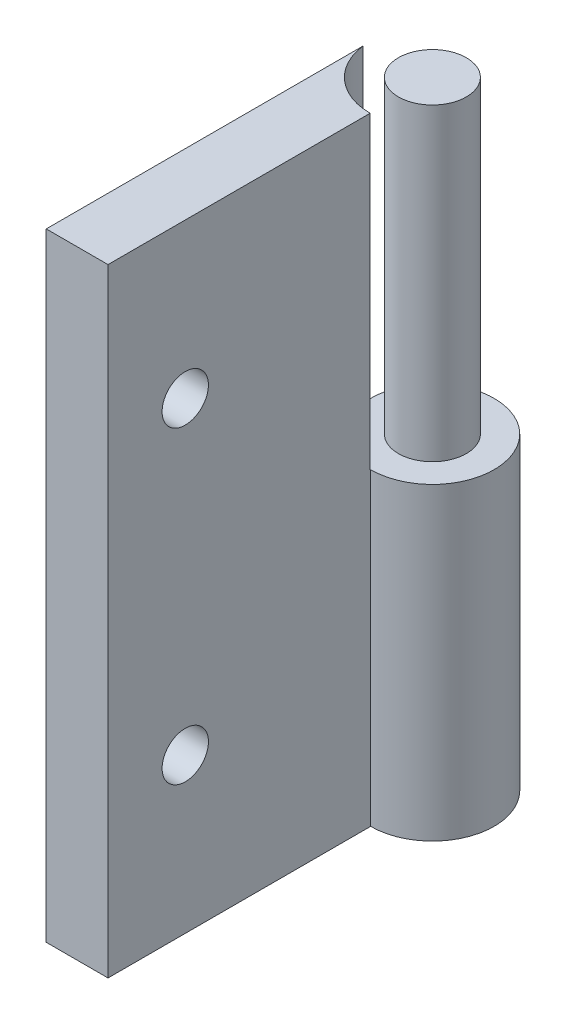
ISO-10303-21;
HEADER;
FILE_DESCRIPTION(('STEP AP214'),'2;1');
FILE_NAME('part.step','',(''),(''),'','','');
FILE_SCHEMA(('AUTOMOTIVE_DESIGN { 1 0 10303 214 1 1 1 1 }'));
ENDSEC;
DATA;
#1=APPLICATION_CONTEXT('core data for automotive mechanical design processes');
#2=APPLICATION_PROTOCOL_DEFINITION('international standard','automotive_design',2000,#1);
#3=PRODUCT_CONTEXT('',#1,'mechanical');
#4=PRODUCT('Part','Part','',(#3));
#5=PRODUCT_RELATED_PRODUCT_CATEGORY('part','',(#4));
#6=PRODUCT_DEFINITION_FORMATION('','',#4);
#7=PRODUCT_DEFINITION_CONTEXT('part definition',#1,'design');
#8=PRODUCT_DEFINITION('design','',#6,#7);
#9=PRODUCT_DEFINITION_SHAPE('','',#8);
#10=(LENGTH_UNIT() NAMED_UNIT(*) SI_UNIT(.MILLI.,.METRE.));
#11=(NAMED_UNIT(*) PLANE_ANGLE_UNIT() SI_UNIT($,.RADIAN.));
#12=(NAMED_UNIT(*) SI_UNIT($,.STERADIAN.) SOLID_ANGLE_UNIT());
#13=UNCERTAINTY_MEASURE_WITH_UNIT(LENGTH_MEASURE(1.E-05),#10,'distance_accuracy_value','');
#14=(GEOMETRIC_REPRESENTATION_CONTEXT(3) GLOBAL_UNCERTAINTY_ASSIGNED_CONTEXT((#13)) GLOBAL_UNIT_ASSIGNED_CONTEXT((#10,
#11,#12)) REPRESENTATION_CONTEXT('',''));
#15=CARTESIAN_POINT('',(0.,0.,0.));
#16=DIRECTION('',(0.,0.,1.));
#17=DIRECTION('',(1.,0.,0.));
#18=AXIS2_PLACEMENT_3D('',#15,#16,#17);
#19=CARTESIAN_POINT('',(4.,0.,0.));
#20=DIRECTION('',(0.,1.,0.));
#21=DIRECTION('',(0.,0.,1.));
#22=AXIS2_PLACEMENT_3D('',#19,#20,#21);
#23=CYLINDRICAL_SURFACE('',#22,4.);
#24=DIRECTION('',(0.,1.,0.));
#25=VECTOR('',#24,1.);
#26=CARTESIAN_POINT('',(0.,0.,0.));
#27=LINE('',#26,#25);
#28=CARTESIAN_POINT('',(0.,0.,0.));
#29=VERTEX_POINT('',#28);
#30=CARTESIAN_POINT('',(0.,20.,0.));
#31=VERTEX_POINT('',#30);
#32=EDGE_CURVE('E114',#29,#31,#27,.T.);
#33=ORIENTED_EDGE('',*,*,#32,.T.);
#34=CARTESIAN_POINT('',(4.,20.,0.));
#35=DIRECTION('',(0.,1.,0.));
#36=DIRECTION('',(0.,0.,1.));
#37=AXIS2_PLACEMENT_3D('',#34,#35,#36);
#38=CIRCLE('',#37,4.);
#39=CARTESIAN_POINT('',(4.,20.,4.));
#40=VERTEX_POINT('',#39);
#41=EDGE_CURVE('E41',#31,#40,#38,.F.);
#42=ORIENTED_EDGE('',*,*,#41,.T.);
#43=DIRECTION('',(0.,1.,0.));
#44=VECTOR('',#43,1.);
#45=CARTESIAN_POINT('',(4.,0.,4.));
#46=LINE('',#45,#44);
#47=CARTESIAN_POINT('',(4.,0.,4.));
#48=VERTEX_POINT('',#47);
#49=EDGE_CURVE('E118',#48,#40,#46,.T.);
#50=ORIENTED_EDGE('',*,*,#49,.F.);
#51=CARTESIAN_POINT('',(4.,0.,0.));
#52=DIRECTION('',(0.,1.,0.));
#53=DIRECTION('',(0.,0.,1.));
#54=AXIS2_PLACEMENT_3D('',#51,#52,#53);
#55=CIRCLE('',#54,4.);
#56=EDGE_CURVE('E101',#48,#29,#55,.T.);
#57=ORIENTED_EDGE('',*,*,#56,.T.);
#58=EDGE_LOOP('',(#33,#42,#50,#57));
#59=FACE_BOUND('',#58,.T.);
#60=ADVANCED_FACE('F33',(#59),#23,.T.);
#61=CARTESIAN_POINT('',(4.,0.,21.));
#62=DIRECTION('',(-1.,0.,0.));
#63=DIRECTION('',(0.,0.,1.));
#64=AXIS2_PLACEMENT_3D('',#61,#62,#63);
#65=PLANE('',#64);
#66=CARTESIAN_POINT('',(4.,10.,16.));
#67=DIRECTION('',(1.,0.,0.));
#68=DIRECTION('',(0.,0.,-1.));
#69=AXIS2_PLACEMENT_3D('',#66,#67,#68);
#70=CIRCLE('',#69,1.5);
#71=CARTESIAN_POINT('',(4.,10.,14.5));
#72=VERTEX_POINT('',#71);
#73=EDGE_CURVE('E146',#72,#72,#70,.T.);
#74=ORIENTED_EDGE('',*,*,#73,.F.);
#75=EDGE_LOOP('',(#74));
#76=FACE_BOUND('',#75,.T.);
#77=CARTESIAN_POINT('',(4.,30.,16.));
#78=DIRECTION('',(1.,0.,0.));
#79=DIRECTION('',(0.,0.,-1.));
#80=AXIS2_PLACEMENT_3D('',#77,#78,#79);
#81=CIRCLE('',#80,1.5);
#82=CARTESIAN_POINT('',(4.,30.,14.5));
#83=VERTEX_POINT('',#82);
#84=EDGE_CURVE('E140',#83,#83,#81,.T.);
#85=ORIENTED_EDGE('',*,*,#84,.F.);
#86=EDGE_LOOP('',(#85));
#87=FACE_BOUND('',#86,.T.);
#88=DIRECTION('',(0.,0.,-1.));
#89=VECTOR('',#88,1.);
#90=CARTESIAN_POINT('',(4.,20.,21.));
#91=LINE('',#90,#89);
#92=CARTESIAN_POINT('',(4.,20.,4.03));
#93=VERTEX_POINT('',#92);
#94=EDGE_CURVE('E48',#93,#40,#91,.T.);
#95=ORIENTED_EDGE('',*,*,#94,.F.);
#96=DIRECTION('',(0.,1.,0.));
#97=VECTOR('',#96,1.);
#98=CARTESIAN_POINT('',(4.,20.,4.03));
#99=LINE('',#98,#97);
#100=CARTESIAN_POINT('',(4.,40.,4.03));
#101=VERTEX_POINT('',#100);
#102=EDGE_CURVE('E90',#93,#101,#99,.T.);
#103=ORIENTED_EDGE('',*,*,#102,.T.);
#104=DIRECTION('',(0.,0.,-1.));
#105=VECTOR('',#104,1.);
#106=CARTESIAN_POINT('',(4.,40.,21.));
#107=LINE('',#106,#105);
#108=CARTESIAN_POINT('',(4.,40.,21.));
#109=VERTEX_POINT('',#108);
#110=EDGE_CURVE('E99',#109,#101,#107,.T.);
#111=ORIENTED_EDGE('',*,*,#110,.F.);
#112=DIRECTION('',(0.,1.,0.));
#113=VECTOR('',#112,1.);
#114=CARTESIAN_POINT('',(4.,0.,21.));
#115=LINE('',#114,#113);
#116=CARTESIAN_POINT('',(4.,0.,21.));
#117=VERTEX_POINT('',#116);
#118=EDGE_CURVE('E117',#117,#109,#115,.T.);
#119=ORIENTED_EDGE('',*,*,#118,.F.);
#120=DIRECTION('',(0.,0.,-1.));
#121=VECTOR('',#120,1.);
#122=CARTESIAN_POINT('',(4.,0.,21.));
#123=LINE('',#122,#121);
#124=EDGE_CURVE('E56',#117,#48,#123,.T.);
#125=ORIENTED_EDGE('',*,*,#124,.T.);
#126=ORIENTED_EDGE('',*,*,#49,.T.);
#127=EDGE_LOOP('',(#95,#103,#111,#119,#125,#126));
#128=FACE_BOUND('',#127,.T.);
#129=ADVANCED_FACE('F35',(#76,#87,#128),#65,.F.);
#130=CARTESIAN_POINT('',(0.,40.,21.));
#131=DIRECTION('',(0.,1.,0.));
#132=DIRECTION('',(0.,0.,1.));
#133=AXIS2_PLACEMENT_3D('',#130,#131,#132);
#134=PLANE('',#133);
#135=CARTESIAN_POINT('',(4.,40.,0.));
#136=DIRECTION('',(0.,1.,0.));
#137=DIRECTION('',(0.,0.,1.));
#138=AXIS2_PLACEMENT_3D('',#135,#136,#137);
#139=CIRCLE('',#138,4.03);
#140=CARTESIAN_POINT('',(0.,40.,0.490815647672335));
#141=VERTEX_POINT('',#140);
#142=EDGE_CURVE('E86',#141,#101,#139,.T.);
#143=ORIENTED_EDGE('',*,*,#142,.F.);
#144=DIRECTION('',(0.,0.,-1.));
#145=VECTOR('',#144,1.);
#146=CARTESIAN_POINT('',(0.,40.,21.));
#147=LINE('',#146,#145);
#148=CARTESIAN_POINT('',(0.,40.,21.));
#149=VERTEX_POINT('',#148);
#150=EDGE_CURVE('E106',#149,#141,#147,.T.);
#151=ORIENTED_EDGE('',*,*,#150,.F.);
#152=DIRECTION('',(1.,0.,0.));
#153=VECTOR('',#152,1.);
#154=CARTESIAN_POINT('',(0.,40.,21.));
#155=LINE('',#154,#153);
#156=EDGE_CURVE('E105',#149,#109,#155,.T.);
#157=ORIENTED_EDGE('',*,*,#156,.T.);
#158=ORIENTED_EDGE('',*,*,#110,.T.);
#159=EDGE_LOOP('',(#143,#151,#157,#158));
#160=FACE_BOUND('',#159,.T.);
#161=ADVANCED_FACE('F103',(#160),#134,.T.);
#162=CARTESIAN_POINT('',(0.,0.,21.));
#163=DIRECTION('',(-1.,0.,0.));
#164=DIRECTION('',(0.,0.,1.));
#165=AXIS2_PLACEMENT_3D('',#162,#163,#164);
#166=PLANE('',#165);
#167=CARTESIAN_POINT('',(0.,10.,16.));
#168=DIRECTION('',(1.,0.,0.));
#169=DIRECTION('',(0.,0.,-1.));
#170=AXIS2_PLACEMENT_3D('',#167,#168,#169);
#171=CIRCLE('',#170,1.5);
#172=CARTESIAN_POINT('',(0.,10.,14.5));
#173=VERTEX_POINT('',#172);
#174=EDGE_CURVE('E143',#173,#173,#171,.T.);
#175=ORIENTED_EDGE('',*,*,#174,.T.);
#176=EDGE_LOOP('',(#175));
#177=FACE_BOUND('',#176,.T.);
#178=CARTESIAN_POINT('',(0.,30.,16.));
#179=DIRECTION('',(1.,0.,0.));
#180=DIRECTION('',(0.,0.,-1.));
#181=AXIS2_PLACEMENT_3D('',#178,#179,#180);
#182=CIRCLE('',#181,1.5);
#183=CARTESIAN_POINT('',(0.,30.,14.5));
#184=VERTEX_POINT('',#183);
#185=EDGE_CURVE('E137',#184,#184,#182,.T.);
#186=ORIENTED_EDGE('',*,*,#185,.T.);
#187=EDGE_LOOP('',(#186));
#188=FACE_BOUND('',#187,.T.);
#189=DIRECTION('',(0.,1.,0.));
#190=VECTOR('',#189,1.);
#191=CARTESIAN_POINT('',(0.,20.,0.490815647672348));
#192=LINE('',#191,#190);
#193=CARTESIAN_POINT('',(0.,20.,0.490815647672335));
#194=VERTEX_POINT('',#193);
#195=EDGE_CURVE('E11',#194,#141,#192,.T.);
#196=ORIENTED_EDGE('',*,*,#195,.F.);
#197=DIRECTION('',(0.,0.,-1.));
#198=VECTOR('',#197,1.);
#199=CARTESIAN_POINT('',(0.,20.,21.));
#200=LINE('',#199,#198);
#201=EDGE_CURVE('E130',#194,#31,#200,.T.);
#202=ORIENTED_EDGE('',*,*,#201,.T.);
#203=ORIENTED_EDGE('',*,*,#32,.F.);
#204=DIRECTION('',(0.,0.,-1.));
#205=VECTOR('',#204,1.);
#206=CARTESIAN_POINT('',(0.,0.,21.));
#207=LINE('',#206,#205);
#208=CARTESIAN_POINT('',(0.,0.,21.));
#209=VERTEX_POINT('',#208);
#210=EDGE_CURVE('E108',#209,#29,#207,.T.);
#211=ORIENTED_EDGE('',*,*,#210,.F.);
#212=DIRECTION('',(0.,1.,0.));
#213=VECTOR('',#212,1.);
#214=CARTESIAN_POINT('',(0.,0.,21.));
#215=LINE('',#214,#213);
#216=EDGE_CURVE('E121',#209,#149,#215,.T.);
#217=ORIENTED_EDGE('',*,*,#216,.T.);
#218=ORIENTED_EDGE('',*,*,#150,.T.);
#219=EDGE_LOOP('',(#196,#202,#203,#211,#217,#218));
#220=FACE_BOUND('',#219,.T.);
#221=ADVANCED_FACE('F152',(#177,#188,#220),#166,.T.);
#222=CARTESIAN_POINT('',(4.,0.,21.));
#223=DIRECTION('',(0.,-1.,0.));
#224=DIRECTION('',(0.,0.,-1.));
#225=AXIS2_PLACEMENT_3D('',#222,#223,#224);
#226=PLANE('',#225);
#227=ORIENTED_EDGE('',*,*,#210,.T.);
#228=ORIENTED_EDGE('',*,*,#56,.F.);
#229=ORIENTED_EDGE('',*,*,#124,.F.);
#230=DIRECTION('',(-1.,0.,0.));
#231=VECTOR('',#230,1.);
#232=CARTESIAN_POINT('',(4.,0.,21.));
#233=LINE('',#232,#231);
#234=EDGE_CURVE('E113',#117,#209,#233,.T.);
#235=ORIENTED_EDGE('',*,*,#234,.T.);
#236=EDGE_LOOP('',(#227,#228,#229,#235));
#237=FACE_BOUND('',#236,.T.);
#238=ADVANCED_FACE('F188',(#237),#226,.T.);
#239=CARTESIAN_POINT('',(4.,40.,21.));
#240=DIRECTION('',(0.,0.,-1.));
#241=DIRECTION('',(-1.,0.,0.));
#242=AXIS2_PLACEMENT_3D('',#239,#240,#241);
#243=PLANE('',#242);
#244=ORIENTED_EDGE('',*,*,#118,.T.);
#245=ORIENTED_EDGE('',*,*,#156,.F.);
#246=ORIENTED_EDGE('',*,*,#216,.F.);
#247=ORIENTED_EDGE('',*,*,#234,.F.);
#248=EDGE_LOOP('',(#244,#245,#246,#247));
#249=FACE_BOUND('',#248,.T.);
#250=ADVANCED_FACE('F185',(#249),#243,.F.);
#251=CARTESIAN_POINT('',(4.,20.,0.));
#252=DIRECTION('',(0.,1.,0.));
#253=DIRECTION('',(0.,0.,1.));
#254=AXIS2_PLACEMENT_3D('',#251,#252,#253);
#255=CYLINDRICAL_SURFACE('',#254,4.03);
#256=CARTESIAN_POINT('',(4.,20.,0.));
#257=DIRECTION('',(0.,1.,0.));
#258=DIRECTION('',(0.,0.,1.));
#259=AXIS2_PLACEMENT_3D('',#256,#257,#258);
#260=CIRCLE('',#259,4.03);
#261=EDGE_CURVE('E95',#194,#93,#260,.T.);
#262=ORIENTED_EDGE('',*,*,#261,.F.);
#263=ORIENTED_EDGE('',*,*,#195,.T.);
#264=ORIENTED_EDGE('',*,*,#142,.T.);
#265=ORIENTED_EDGE('',*,*,#102,.F.);
#266=EDGE_LOOP('',(#262,#263,#264,#265));
#267=FACE_BOUND('',#266,.T.);
#268=ADVANCED_FACE('F89',(#267),#255,.F.);
#269=CARTESIAN_POINT('',(4.,20.,0.));
#270=DIRECTION('',(0.,1.,0.));
#271=DIRECTION('',(0.,0.,1.));
#272=AXIS2_PLACEMENT_3D('',#269,#270,#271);
#273=PLANE('',#272);
#274=CARTESIAN_POINT('',(4.,20.,0.));
#275=DIRECTION('',(0.,1.,0.));
#276=DIRECTION('',(0.,0.,1.));
#277=AXIS2_PLACEMENT_3D('',#274,#275,#276);
#278=CIRCLE('',#277,2.2);
#279=CARTESIAN_POINT('',(4.,20.,2.2));
#280=VERTEX_POINT('',#279);
#281=EDGE_CURVE('E96',#280,#280,#278,.T.);
#282=ORIENTED_EDGE('',*,*,#281,.F.);
#283=EDGE_LOOP('',(#282));
#284=FACE_BOUND('',#283,.T.);
#285=ORIENTED_EDGE('',*,*,#94,.T.);
#286=ORIENTED_EDGE('',*,*,#41,.F.);
#287=ORIENTED_EDGE('',*,*,#201,.F.);
#288=ORIENTED_EDGE('',*,*,#261,.T.);
#289=EDGE_LOOP('',(#285,#286,#287,#288));
#290=FACE_BOUND('',#289,.T.);
#291=ADVANCED_FACE('F217',(#284,#290),#273,.T.);
#292=CARTESIAN_POINT('',(4.,20.,0.));
#293=DIRECTION('',(0.,1.,0.));
#294=DIRECTION('',(0.,0.,1.));
#295=AXIS2_PLACEMENT_3D('',#292,#293,#294);
#296=CYLINDRICAL_SURFACE('',#295,2.2);
#297=ORIENTED_EDGE('',*,*,#281,.T.);
#298=EDGE_LOOP('',(#297));
#299=FACE_BOUND('',#298,.T.);
#300=CARTESIAN_POINT('',(4.,40.,0.));
#301=DIRECTION('',(0.,1.,0.));
#302=DIRECTION('',(0.,0.,1.));
#303=AXIS2_PLACEMENT_3D('',#300,#301,#302);
#304=CIRCLE('',#303,2.2);
#305=CARTESIAN_POINT('',(4.,40.,2.2));
#306=VERTEX_POINT('',#305);
#307=EDGE_CURVE('E134',#306,#306,#304,.T.);
#308=ORIENTED_EDGE('',*,*,#307,.F.);
#309=EDGE_LOOP('',(#308));
#310=FACE_BOUND('',#309,.T.);
#311=ADVANCED_FACE('F173',(#299,#310),#296,.T.);
#312=ORIENTED_EDGE('',*,*,#307,.T.);
#313=EDGE_LOOP('',(#312));
#314=FACE_BOUND('',#313,.T.);
#315=ADVANCED_FACE('F167',(#314),#134,.T.);
#316=CARTESIAN_POINT('',(0.,30.,16.));
#317=DIRECTION('',(1.,0.,0.));
#318=DIRECTION('',(0.,0.,-1.));
#319=AXIS2_PLACEMENT_3D('',#316,#317,#318);
#320=CYLINDRICAL_SURFACE('',#319,1.5);
#321=ORIENTED_EDGE('',*,*,#185,.F.);
#322=EDGE_LOOP('',(#321));
#323=FACE_BOUND('',#322,.T.);
#324=ORIENTED_EDGE('',*,*,#84,.T.);
#325=EDGE_LOOP('',(#324));
#326=FACE_BOUND('',#325,.T.);
#327=ADVANCED_FACE('F158',(#323,#326),#320,.F.);
#328=CARTESIAN_POINT('',(0.,10.,16.));
#329=DIRECTION('',(1.,0.,0.));
#330=DIRECTION('',(0.,0.,-1.));
#331=AXIS2_PLACEMENT_3D('',#328,#329,#330);
#332=CYLINDRICAL_SURFACE('',#331,1.5);
#333=ORIENTED_EDGE('',*,*,#174,.F.);
#334=EDGE_LOOP('',(#333));
#335=FACE_BOUND('',#334,.T.);
#336=ORIENTED_EDGE('',*,*,#73,.T.);
#337=EDGE_LOOP('',(#336));
#338=FACE_BOUND('',#337,.T.);
#339=ADVANCED_FACE('F155',(#335,#338),#332,.F.);
#340=CLOSED_SHELL('',(#60,#129,#161,#221,#238,#250,#268,#291,#311,#315,#327,#339));
#341=MANIFOLD_SOLID_BREP('B2',#340);
#342=ADVANCED_BREP_SHAPE_REPRESENTATION('',(#18,#341),#14);
#343=SHAPE_DEFINITION_REPRESENTATION(#9,#342);
ENDSEC;
END-ISO-10303-21;
